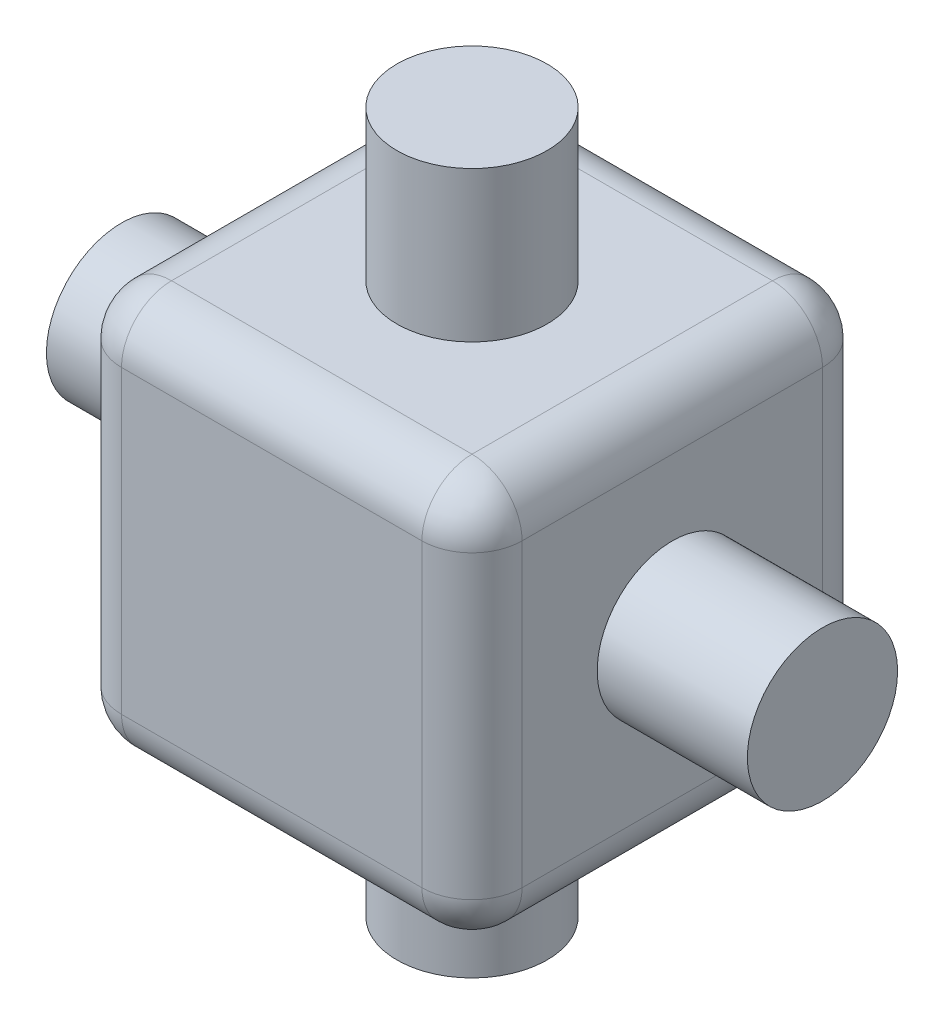
ISO-10303-21;
HEADER;
FILE_DESCRIPTION(('STEP AP214'),'2;1');
FILE_NAME('part.step','',(''),(''),'','','');
FILE_SCHEMA(('AUTOMOTIVE_DESIGN { 1 0 10303 214 1 1 1 1 }'));
ENDSEC;
DATA;
#1=APPLICATION_CONTEXT('core data for automotive mechanical design processes');
#2=APPLICATION_PROTOCOL_DEFINITION('international standard','automotive_design',2000,#1);
#3=PRODUCT_CONTEXT('',#1,'mechanical');
#4=PRODUCT('Part','Part','',(#3));
#5=PRODUCT_RELATED_PRODUCT_CATEGORY('part','',(#4));
#6=PRODUCT_DEFINITION_FORMATION('','',#4);
#7=PRODUCT_DEFINITION_CONTEXT('part definition',#1,'design');
#8=PRODUCT_DEFINITION('design','',#6,#7);
#9=PRODUCT_DEFINITION_SHAPE('','',#8);
#10=(LENGTH_UNIT() NAMED_UNIT(*) SI_UNIT(.MILLI.,.METRE.));
#11=(NAMED_UNIT(*) PLANE_ANGLE_UNIT() SI_UNIT($,.RADIAN.));
#12=(NAMED_UNIT(*) SI_UNIT($,.STERADIAN.) SOLID_ANGLE_UNIT());
#13=UNCERTAINTY_MEASURE_WITH_UNIT(LENGTH_MEASURE(1.E-05),#10,'distance_accuracy_value','');
#14=(GEOMETRIC_REPRESENTATION_CONTEXT(3) GLOBAL_UNCERTAINTY_ASSIGNED_CONTEXT((#13)) GLOBAL_UNIT_ASSIGNED_CONTEXT((#10,
#11,#12)) REPRESENTATION_CONTEXT('',''));
#15=CARTESIAN_POINT('',(0.,0.,0.));
#16=DIRECTION('',(0.,0.,1.));
#17=DIRECTION('',(1.,0.,0.));
#18=AXIS2_PLACEMENT_3D('',#15,#16,#17);
#19=CARTESIAN_POINT('',(0.,3.,1.));
#20=DIRECTION('',(1.,0.,0.));
#21=DIRECTION('',(0.,1.,0.));
#22=AXIS2_PLACEMENT_3D('',#19,#20,#21);
#23=CYLINDRICAL_SURFACE('',#22,1.);
#24=CARTESIAN_POINT('',(3.,3.,1.));
#25=DIRECTION('',(1.,0.,0.));
#26=DIRECTION('',(0.,0.,-1.));
#27=AXIS2_PLACEMENT_3D('',#24,#25,#26);
#28=CIRCLE('',#27,1.);
#29=CARTESIAN_POINT('',(3.,3.,0.));
#30=VERTEX_POINT('',#29);
#31=CARTESIAN_POINT('',(3.,4.,1.));
#32=VERTEX_POINT('',#31);
#33=EDGE_CURVE('E11',#30,#32,#28,.T.);
#34=ORIENTED_EDGE('',*,*,#33,.F.);
#35=DIRECTION('',(1.,0.,0.));
#36=VECTOR('',#35,1.);
#37=CARTESIAN_POINT('',(0.,3.,0.));
#38=LINE('',#37,#36);
#39=CARTESIAN_POINT('',(-3.,3.,0.));
#40=VERTEX_POINT('',#39);
#41=EDGE_CURVE('E307',#40,#30,#38,.T.);
#42=ORIENTED_EDGE('',*,*,#41,.F.);
#43=CARTESIAN_POINT('',(-3.,3.,1.));
#44=DIRECTION('',(1.,0.,0.));
#45=DIRECTION('',(0.,0.,-1.));
#46=AXIS2_PLACEMENT_3D('',#43,#44,#45);
#47=CIRCLE('',#46,1.);
#48=CARTESIAN_POINT('',(-3.,4.,1.));
#49=VERTEX_POINT('',#48);
#50=EDGE_CURVE('E55',#40,#49,#47,.T.);
#51=ORIENTED_EDGE('',*,*,#50,.T.);
#52=DIRECTION('',(1.,0.,0.));
#53=VECTOR('',#52,1.);
#54=CARTESIAN_POINT('',(4.,4.,1.));
#55=LINE('',#54,#53);
#56=EDGE_CURVE('E271',#32,#49,#55,.F.);
#57=ORIENTED_EDGE('',*,*,#56,.F.);
#58=EDGE_LOOP('',(#34,#42,#51,#57));
#59=FACE_BOUND('',#58,.T.);
#60=ADVANCED_FACE('F47',(#59),#23,.T.);
#61=CARTESIAN_POINT('',(-3.,3.,1.));
#62=DIRECTION('',(0.,-1.,0.));
#63=DIRECTION('',(1.,0.,0.));
#64=AXIS2_PLACEMENT_3D('',#61,#62,#63);
#65=SPHERICAL_SURFACE('',#64,1.);
#66=ORIENTED_EDGE('',*,*,#50,.F.);
#67=CARTESIAN_POINT('',(-3.,3.,1.));
#68=DIRECTION('',(0.,1.,0.));
#69=DIRECTION('',(0.,0.,1.));
#70=AXIS2_PLACEMENT_3D('',#67,#68,#69);
#71=CIRCLE('',#70,1.);
#72=CARTESIAN_POINT('',(-4.,3.,1.));
#73=VERTEX_POINT('',#72);
#74=EDGE_CURVE('E303',#73,#40,#71,.F.);
#75=ORIENTED_EDGE('',*,*,#74,.F.);
#76=CARTESIAN_POINT('',(-3.,3.,1.));
#77=DIRECTION('',(0.,0.,-1.));
#78=DIRECTION('',(-1.,0.,0.));
#79=AXIS2_PLACEMENT_3D('',#76,#77,#78);
#80=CIRCLE('',#79,1.);
#81=EDGE_CURVE('E68',#73,#49,#80,.T.);
#82=ORIENTED_EDGE('',*,*,#81,.T.);
#83=EDGE_LOOP('',(#66,#75,#82));
#84=FACE_BOUND('',#83,.T.);
#85=ADVANCED_FACE('F333',(#84),#65,.T.);
#86=CARTESIAN_POINT('',(-3.,3.,8.));
#87=DIRECTION('',(0.,0.,-1.));
#88=DIRECTION('',(-1.,0.,0.));
#89=AXIS2_PLACEMENT_3D('',#86,#87,#88);
#90=CYLINDRICAL_SURFACE('',#89,1.);
#91=ORIENTED_EDGE('',*,*,#81,.F.);
#92=DIRECTION('',(0.,0.,-1.));
#93=VECTOR('',#92,1.);
#94=CARTESIAN_POINT('',(-4.,3.,8.));
#95=LINE('',#94,#93);
#96=CARTESIAN_POINT('',(-4.,3.,7.));
#97=VERTEX_POINT('',#96);
#98=EDGE_CURVE('E299',#97,#73,#95,.T.);
#99=ORIENTED_EDGE('',*,*,#98,.F.);
#100=CARTESIAN_POINT('',(-3.,3.,7.));
#101=DIRECTION('',(0.,0.,-1.));
#102=DIRECTION('',(-1.,0.,0.));
#103=AXIS2_PLACEMENT_3D('',#100,#101,#102);
#104=CIRCLE('',#103,1.);
#105=CARTESIAN_POINT('',(-3.,4.,7.));
#106=VERTEX_POINT('',#105);
#107=EDGE_CURVE('E326',#97,#106,#104,.T.);
#108=ORIENTED_EDGE('',*,*,#107,.T.);
#109=DIRECTION('',(0.,0.,-1.));
#110=VECTOR('',#109,1.);
#111=CARTESIAN_POINT('',(-3.,4.,8.));
#112=LINE('',#111,#110);
#113=EDGE_CURVE('E275',#49,#106,#112,.F.);
#114=ORIENTED_EDGE('',*,*,#113,.F.);
#115=EDGE_LOOP('',(#91,#99,#108,#114));
#116=FACE_BOUND('',#115,.T.);
#117=ADVANCED_FACE('F334',(#116),#90,.T.);
#118=CARTESIAN_POINT('',(-3.,3.,7.));
#119=DIRECTION('',(0.,-1.,0.));
#120=DIRECTION('',(1.,0.,0.));
#121=AXIS2_PLACEMENT_3D('',#118,#119,#120);
#122=SPHERICAL_SURFACE('',#121,1.);
#123=ORIENTED_EDGE('',*,*,#107,.F.);
#124=CARTESIAN_POINT('',(-3.,3.,7.));
#125=DIRECTION('',(0.,-1.,0.));
#126=DIRECTION('',(0.,0.,-1.));
#127=AXIS2_PLACEMENT_3D('',#124,#125,#126);
#128=CIRCLE('',#127,1.);
#129=CARTESIAN_POINT('',(-3.,3.,8.));
#130=VERTEX_POINT('',#129);
#131=EDGE_CURVE('E295',#130,#97,#128,.T.);
#132=ORIENTED_EDGE('',*,*,#131,.F.);
#133=CARTESIAN_POINT('',(-3.,3.,7.));
#134=DIRECTION('',(-1.,0.,0.));
#135=DIRECTION('',(0.,0.,1.));
#136=AXIS2_PLACEMENT_3D('',#133,#134,#135);
#137=CIRCLE('',#136,1.);
#138=EDGE_CURVE('E322',#130,#106,#137,.T.);
#139=ORIENTED_EDGE('',*,*,#138,.T.);
#140=EDGE_LOOP('',(#123,#132,#139));
#141=FACE_BOUND('',#140,.T.);
#142=ADVANCED_FACE('F387',(#141),#122,.T.);
#143=CARTESIAN_POINT('',(0.,3.,7.));
#144=DIRECTION('',(1.,0.,0.));
#145=DIRECTION('',(0.,1.,0.));
#146=AXIS2_PLACEMENT_3D('',#143,#144,#145);
#147=CYLINDRICAL_SURFACE('',#146,1.);
#148=ORIENTED_EDGE('',*,*,#138,.F.);
#149=DIRECTION('',(-1.,0.,0.));
#150=VECTOR('',#149,1.);
#151=CARTESIAN_POINT('',(0.,3.,8.));
#152=LINE('',#151,#150);
#153=CARTESIAN_POINT('',(3.,3.,8.));
#154=VERTEX_POINT('',#153);
#155=EDGE_CURVE('E291',#154,#130,#152,.T.);
#156=ORIENTED_EDGE('',*,*,#155,.F.);
#157=CARTESIAN_POINT('',(3.,3.,7.));
#158=DIRECTION('',(-1.,0.,0.));
#159=DIRECTION('',(0.,0.,1.));
#160=AXIS2_PLACEMENT_3D('',#157,#158,#159);
#161=CIRCLE('',#160,1.);
#162=CARTESIAN_POINT('',(3.,4.,7.));
#163=VERTEX_POINT('',#162);
#164=EDGE_CURVE('E319',#154,#163,#161,.T.);
#165=ORIENTED_EDGE('',*,*,#164,.T.);
#166=DIRECTION('',(-1.,0.,0.));
#167=VECTOR('',#166,1.);
#168=CARTESIAN_POINT('',(0.,4.,7.));
#169=LINE('',#168,#167);
#170=EDGE_CURVE('E279',#106,#163,#169,.F.);
#171=ORIENTED_EDGE('',*,*,#170,.F.);
#172=EDGE_LOOP('',(#148,#156,#165,#171));
#173=FACE_BOUND('',#172,.T.);
#174=ADVANCED_FACE('F392',(#173),#147,.T.);
#175=CARTESIAN_POINT('',(3.,3.,7.));
#176=DIRECTION('',(0.,-1.,0.));
#177=DIRECTION('',(1.,0.,0.));
#178=AXIS2_PLACEMENT_3D('',#175,#176,#177);
#179=SPHERICAL_SURFACE('',#178,1.);
#180=ORIENTED_EDGE('',*,*,#164,.F.);
#181=CARTESIAN_POINT('',(3.,3.,7.));
#182=DIRECTION('',(0.,-1.,0.));
#183=DIRECTION('',(0.,0.,-1.));
#184=AXIS2_PLACEMENT_3D('',#181,#182,#183);
#185=CIRCLE('',#184,1.);
#186=CARTESIAN_POINT('',(4.,3.,7.));
#187=VERTEX_POINT('',#186);
#188=EDGE_CURVE('E287',#187,#154,#185,.T.);
#189=ORIENTED_EDGE('',*,*,#188,.F.);
#190=CARTESIAN_POINT('',(3.,3.,7.));
#191=DIRECTION('',(0.,0.,1.));
#192=DIRECTION('',(1.,0.,0.));
#193=AXIS2_PLACEMENT_3D('',#190,#191,#192);
#194=CIRCLE('',#193,1.);
#195=EDGE_CURVE('E315',#187,#163,#194,.T.);
#196=ORIENTED_EDGE('',*,*,#195,.T.);
#197=EDGE_LOOP('',(#180,#189,#196));
#198=FACE_BOUND('',#197,.T.);
#199=ADVANCED_FACE('F396',(#198),#179,.T.);
#200=CARTESIAN_POINT('',(3.,3.,8.));
#201=DIRECTION('',(0.,0.,1.));
#202=DIRECTION('',(1.,0.,0.));
#203=AXIS2_PLACEMENT_3D('',#200,#201,#202);
#204=CYLINDRICAL_SURFACE('',#203,1.);
#205=ORIENTED_EDGE('',*,*,#195,.F.);
#206=DIRECTION('',(0.,0.,1.));
#207=VECTOR('',#206,1.);
#208=CARTESIAN_POINT('',(4.,3.,8.));
#209=LINE('',#208,#207);
#210=CARTESIAN_POINT('',(4.,3.,1.));
#211=VERTEX_POINT('',#210);
#212=EDGE_CURVE('E268',#211,#187,#209,.T.);
#213=ORIENTED_EDGE('',*,*,#212,.F.);
#214=CARTESIAN_POINT('',(3.,3.,1.));
#215=DIRECTION('',(0.,0.,1.));
#216=DIRECTION('',(1.,0.,0.));
#217=AXIS2_PLACEMENT_3D('',#214,#215,#216);
#218=CIRCLE('',#217,1.);
#219=EDGE_CURVE('E311',#211,#32,#218,.T.);
#220=ORIENTED_EDGE('',*,*,#219,.T.);
#221=DIRECTION('',(0.,0.,1.));
#222=VECTOR('',#221,1.);
#223=CARTESIAN_POINT('',(3.,4.,8.));
#224=LINE('',#223,#222);
#225=EDGE_CURVE('E283',#163,#32,#224,.F.);
#226=ORIENTED_EDGE('',*,*,#225,.F.);
#227=EDGE_LOOP('',(#205,#213,#220,#226));
#228=FACE_BOUND('',#227,.T.);
#229=ADVANCED_FACE('F341',(#228),#204,.T.);
#230=CARTESIAN_POINT('',(3.,3.,1.));
#231=DIRECTION('',(0.,-1.,0.));
#232=DIRECTION('',(1.,0.,0.));
#233=AXIS2_PLACEMENT_3D('',#230,#231,#232);
#234=SPHERICAL_SURFACE('',#233,1.);
#235=CARTESIAN_POINT('',(3.,3.,1.));
#236=DIRECTION('',(0.,1.,0.));
#237=DIRECTION('',(0.,0.,1.));
#238=AXIS2_PLACEMENT_3D('',#235,#236,#237);
#239=CIRCLE('',#238,1.);
#240=EDGE_CURVE('E176',#30,#211,#239,.F.);
#241=ORIENTED_EDGE('',*,*,#240,.F.);
#242=ORIENTED_EDGE('',*,*,#33,.T.);
#243=ORIENTED_EDGE('',*,*,#219,.F.);
#244=EDGE_LOOP('',(#241,#242,#243));
#245=FACE_BOUND('',#244,.T.);
#246=ADVANCED_FACE('F345',(#245),#234,.T.);
#247=CARTESIAN_POINT('',(4.,-3.,1.));
#248=DIRECTION('',(1.,0.,0.));
#249=DIRECTION('',(0.,0.,-1.));
#250=AXIS2_PLACEMENT_3D('',#247,#248,#249);
#251=CYLINDRICAL_SURFACE('',#250,1.);
#252=CARTESIAN_POINT('',(3.,-3.,1.));
#253=DIRECTION('',(1.,0.,0.));
#254=DIRECTION('',(0.,0.,-1.));
#255=AXIS2_PLACEMENT_3D('',#252,#253,#254);
#256=CIRCLE('',#255,1.);
#257=CARTESIAN_POINT('',(3.,-4.,1.));
#258=VERTEX_POINT('',#257);
#259=CARTESIAN_POINT('',(3.,-3.,0.));
#260=VERTEX_POINT('',#259);
#261=EDGE_CURVE('E166',#258,#260,#256,.T.);
#262=ORIENTED_EDGE('',*,*,#261,.F.);
#263=DIRECTION('',(1.,0.,0.));
#264=VECTOR('',#263,1.);
#265=CARTESIAN_POINT('',(4.,-4.,1.));
#266=LINE('',#265,#264);
#267=CARTESIAN_POINT('',(-3.,-4.,1.));
#268=VERTEX_POINT('',#267);
#269=EDGE_CURVE('E171',#268,#258,#266,.T.);
#270=ORIENTED_EDGE('',*,*,#269,.F.);
#271=CARTESIAN_POINT('',(-3.,-3.,1.));
#272=DIRECTION('',(1.,0.,0.));
#273=DIRECTION('',(0.,0.,-1.));
#274=AXIS2_PLACEMENT_3D('',#271,#272,#273);
#275=CIRCLE('',#274,1.);
#276=CARTESIAN_POINT('',(-3.,-3.,0.));
#277=VERTEX_POINT('',#276);
#278=EDGE_CURVE('E261',#268,#277,#275,.T.);
#279=ORIENTED_EDGE('',*,*,#278,.T.);
#280=DIRECTION('',(1.,0.,0.));
#281=VECTOR('',#280,1.);
#282=CARTESIAN_POINT('',(0.,-3.,0.));
#283=LINE('',#282,#281);
#284=EDGE_CURVE('E149',#260,#277,#283,.F.);
#285=ORIENTED_EDGE('',*,*,#284,.F.);
#286=EDGE_LOOP('',(#262,#270,#279,#285));
#287=FACE_BOUND('',#286,.T.);
#288=ADVANCED_FACE('F369',(#287),#251,.T.);
#289=CARTESIAN_POINT('',(-3.,-3.,1.));
#290=DIRECTION('',(0.,1.,0.));
#291=DIRECTION('',(0.,0.,1.));
#292=AXIS2_PLACEMENT_3D('',#289,#290,#291);
#293=SPHERICAL_SURFACE('',#292,1.);
#294=ORIENTED_EDGE('',*,*,#278,.F.);
#295=CARTESIAN_POINT('',(-3.,-3.,1.));
#296=DIRECTION('',(0.,0.,-1.));
#297=DIRECTION('',(-1.,0.,0.));
#298=AXIS2_PLACEMENT_3D('',#295,#296,#297);
#299=CIRCLE('',#298,1.);
#300=CARTESIAN_POINT('',(-4.,-3.,1.));
#301=VERTEX_POINT('',#300);
#302=EDGE_CURVE('E257',#268,#301,#299,.T.);
#303=ORIENTED_EDGE('',*,*,#302,.T.);
#304=CARTESIAN_POINT('',(-3.,-3.,1.));
#305=DIRECTION('',(0.,1.,0.));
#306=DIRECTION('',(0.,0.,1.));
#307=AXIS2_PLACEMENT_3D('',#304,#305,#306);
#308=CIRCLE('',#307,1.);
#309=EDGE_CURVE('E238',#277,#301,#308,.T.);
#310=ORIENTED_EDGE('',*,*,#309,.F.);
#311=EDGE_LOOP('',(#294,#303,#310));
#312=FACE_BOUND('',#311,.T.);
#313=ADVANCED_FACE('F359',(#312),#293,.T.);
#314=CARTESIAN_POINT('',(-3.,-3.,8.));
#315=DIRECTION('',(0.,0.,-1.));
#316=DIRECTION('',(-1.,0.,0.));
#317=AXIS2_PLACEMENT_3D('',#314,#315,#316);
#318=CYLINDRICAL_SURFACE('',#317,1.);
#319=ORIENTED_EDGE('',*,*,#302,.F.);
#320=DIRECTION('',(0.,0.,-1.));
#321=VECTOR('',#320,1.);
#322=CARTESIAN_POINT('',(-3.,-4.,8.));
#323=LINE('',#322,#321);
#324=CARTESIAN_POINT('',(-3.,-4.,7.));
#325=VERTEX_POINT('',#324);
#326=EDGE_CURVE('E213',#325,#268,#323,.T.);
#327=ORIENTED_EDGE('',*,*,#326,.F.);
#328=CARTESIAN_POINT('',(-3.,-3.,7.));
#329=DIRECTION('',(0.,0.,-1.));
#330=DIRECTION('',(-1.,0.,0.));
#331=AXIS2_PLACEMENT_3D('',#328,#329,#330);
#332=CIRCLE('',#331,1.);
#333=CARTESIAN_POINT('',(-4.,-3.,7.));
#334=VERTEX_POINT('',#333);
#335=EDGE_CURVE('E254',#325,#334,#332,.T.);
#336=ORIENTED_EDGE('',*,*,#335,.T.);
#337=DIRECTION('',(0.,0.,-1.));
#338=VECTOR('',#337,1.);
#339=CARTESIAN_POINT('',(-4.,-3.,8.));
#340=LINE('',#339,#338);
#341=EDGE_CURVE('E234',#301,#334,#340,.F.);
#342=ORIENTED_EDGE('',*,*,#341,.F.);
#343=EDGE_LOOP('',(#319,#327,#336,#342));
#344=FACE_BOUND('',#343,.T.);
#345=ADVANCED_FACE('F362',(#344),#318,.T.);
#346=CARTESIAN_POINT('',(-3.,-3.,7.));
#347=DIRECTION('',(0.,1.,0.));
#348=DIRECTION('',(0.,0.,1.));
#349=AXIS2_PLACEMENT_3D('',#346,#347,#348);
#350=SPHERICAL_SURFACE('',#349,1.);
#351=ORIENTED_EDGE('',*,*,#335,.F.);
#352=CARTESIAN_POINT('',(-3.,-3.,7.));
#353=DIRECTION('',(-1.,0.,0.));
#354=DIRECTION('',(0.,0.,1.));
#355=AXIS2_PLACEMENT_3D('',#352,#353,#354);
#356=CIRCLE('',#355,1.);
#357=CARTESIAN_POINT('',(-3.,-3.,8.));
#358=VERTEX_POINT('',#357);
#359=EDGE_CURVE('E250',#325,#358,#356,.T.);
#360=ORIENTED_EDGE('',*,*,#359,.T.);
#361=CARTESIAN_POINT('',(-3.,-3.,7.));
#362=DIRECTION('',(0.,-1.,0.));
#363=DIRECTION('',(0.,0.,-1.));
#364=AXIS2_PLACEMENT_3D('',#361,#362,#363);
#365=CIRCLE('',#364,1.);
#366=EDGE_CURVE('E230',#334,#358,#365,.F.);
#367=ORIENTED_EDGE('',*,*,#366,.F.);
#368=EDGE_LOOP('',(#351,#360,#367));
#369=FACE_BOUND('',#368,.T.);
#370=ADVANCED_FACE('F584',(#369),#350,.T.);
#371=CARTESIAN_POINT('',(4.,-3.,7.));
#372=DIRECTION('',(1.,0.,0.));
#373=DIRECTION('',(0.,0.,-1.));
#374=AXIS2_PLACEMENT_3D('',#371,#372,#373);
#375=CYLINDRICAL_SURFACE('',#374,1.);
#376=ORIENTED_EDGE('',*,*,#359,.F.);
#377=DIRECTION('',(-1.,0.,0.));
#378=VECTOR('',#377,1.);
#379=CARTESIAN_POINT('',(4.,-4.,7.));
#380=LINE('',#379,#378);
#381=CARTESIAN_POINT('',(3.,-4.,7.));
#382=VERTEX_POINT('',#381);
#383=EDGE_CURVE('E217',#382,#325,#380,.T.);
#384=ORIENTED_EDGE('',*,*,#383,.F.);
#385=CARTESIAN_POINT('',(3.,-3.,7.));
#386=DIRECTION('',(-1.,0.,0.));
#387=DIRECTION('',(0.,0.,1.));
#388=AXIS2_PLACEMENT_3D('',#385,#386,#387);
#389=CIRCLE('',#388,1.);
#390=CARTESIAN_POINT('',(3.,-3.,8.));
#391=VERTEX_POINT('',#390);
#392=EDGE_CURVE('E247',#382,#391,#389,.T.);
#393=ORIENTED_EDGE('',*,*,#392,.T.);
#394=DIRECTION('',(-1.,0.,0.));
#395=VECTOR('',#394,1.);
#396=CARTESIAN_POINT('',(4.,-3.,8.));
#397=LINE('',#396,#395);
#398=EDGE_CURVE('E226',#358,#391,#397,.F.);
#399=ORIENTED_EDGE('',*,*,#398,.F.);
#400=EDGE_LOOP('',(#376,#384,#393,#399));
#401=FACE_BOUND('',#400,.T.);
#402=ADVANCED_FACE('F592',(#401),#375,.T.);
#403=CARTESIAN_POINT('',(3.,-3.,7.));
#404=DIRECTION('',(0.,1.,0.));
#405=DIRECTION('',(0.,0.,1.));
#406=AXIS2_PLACEMENT_3D('',#403,#404,#405);
#407=SPHERICAL_SURFACE('',#406,1.);
#408=ORIENTED_EDGE('',*,*,#392,.F.);
#409=CARTESIAN_POINT('',(3.,-3.,7.));
#410=DIRECTION('',(0.,0.,1.));
#411=DIRECTION('',(1.,0.,0.));
#412=AXIS2_PLACEMENT_3D('',#409,#410,#411);
#413=CIRCLE('',#412,1.);
#414=CARTESIAN_POINT('',(4.,-3.,7.));
#415=VERTEX_POINT('',#414);
#416=EDGE_CURVE('E148',#382,#415,#413,.T.);
#417=ORIENTED_EDGE('',*,*,#416,.T.);
#418=CARTESIAN_POINT('',(3.,-3.,7.));
#419=DIRECTION('',(0.,-1.,0.));
#420=DIRECTION('',(0.,0.,-1.));
#421=AXIS2_PLACEMENT_3D('',#418,#419,#420);
#422=CIRCLE('',#421,1.);
#423=EDGE_CURVE('E161',#391,#415,#422,.F.);
#424=ORIENTED_EDGE('',*,*,#423,.F.);
#425=EDGE_LOOP('',(#408,#417,#424));
#426=FACE_BOUND('',#425,.T.);
#427=ADVANCED_FACE('F601',(#426),#407,.T.);
#428=CARTESIAN_POINT('',(3.,-3.,8.));
#429=DIRECTION('',(0.,0.,1.));
#430=DIRECTION('',(1.,0.,0.));
#431=AXIS2_PLACEMENT_3D('',#428,#429,#430);
#432=CYLINDRICAL_SURFACE('',#431,1.);
#433=ORIENTED_EDGE('',*,*,#416,.F.);
#434=DIRECTION('',(0.,0.,1.));
#435=VECTOR('',#434,1.);
#436=CARTESIAN_POINT('',(3.,-4.,8.));
#437=LINE('',#436,#435);
#438=EDGE_CURVE('E142',#258,#382,#437,.T.);
#439=ORIENTED_EDGE('',*,*,#438,.F.);
#440=CARTESIAN_POINT('',(3.,-3.,1.));
#441=DIRECTION('',(0.,0.,1.));
#442=DIRECTION('',(1.,0.,0.));
#443=AXIS2_PLACEMENT_3D('',#440,#441,#442);
#444=CIRCLE('',#443,1.);
#445=CARTESIAN_POINT('',(4.,-3.,1.));
#446=VERTEX_POINT('',#445);
#447=EDGE_CURVE('E136',#258,#446,#444,.T.);
#448=ORIENTED_EDGE('',*,*,#447,.T.);
#449=DIRECTION('',(0.,0.,1.));
#450=VECTOR('',#449,1.);
#451=CARTESIAN_POINT('',(4.,-3.,8.));
#452=LINE('',#451,#450);
#453=EDGE_CURVE('E140',#415,#446,#452,.F.);
#454=ORIENTED_EDGE('',*,*,#453,.F.);
#455=EDGE_LOOP('',(#433,#439,#448,#454));
#456=FACE_BOUND('',#455,.T.);
#457=ADVANCED_FACE('F139',(#456),#432,.T.);
#458=CARTESIAN_POINT('',(3.,-3.,1.));
#459=DIRECTION('',(0.,1.,0.));
#460=DIRECTION('',(0.,0.,1.));
#461=AXIS2_PLACEMENT_3D('',#458,#459,#460);
#462=SPHERICAL_SURFACE('',#461,1.);
#463=ORIENTED_EDGE('',*,*,#447,.F.);
#464=ORIENTED_EDGE('',*,*,#261,.T.);
#465=CARTESIAN_POINT('',(3.,-3.,1.));
#466=DIRECTION('',(0.,1.,0.));
#467=DIRECTION('',(0.,0.,1.));
#468=AXIS2_PLACEMENT_3D('',#465,#466,#467);
#469=CIRCLE('',#468,1.);
#470=EDGE_CURVE('E164',#446,#260,#469,.T.);
#471=ORIENTED_EDGE('',*,*,#470,.F.);
#472=EDGE_LOOP('',(#463,#464,#471));
#473=FACE_BOUND('',#472,.T.);
#474=ADVANCED_FACE('F165',(#473),#462,.T.);
#475=CARTESIAN_POINT('',(3.,0.,7.));
#476=DIRECTION('',(0.,-1.,0.));
#477=DIRECTION('',(0.,0.,-1.));
#478=AXIS2_PLACEMENT_3D('',#475,#476,#477);
#479=CYLINDRICAL_SURFACE('',#478,1.);
#480=DIRECTION('',(0.,1.,0.));
#481=VECTOR('',#480,1.);
#482=CARTESIAN_POINT('',(4.,0.,7.));
#483=LINE('',#482,#481);
#484=EDGE_CURVE('E158',#187,#415,#483,.F.);
#485=ORIENTED_EDGE('',*,*,#484,.F.);
#486=ORIENTED_EDGE('',*,*,#188,.T.);
#487=DIRECTION('',(0.,1.,0.));
#488=VECTOR('',#487,1.);
#489=CARTESIAN_POINT('',(3.,0.,8.));
#490=LINE('',#489,#488);
#491=EDGE_CURVE('E205',#391,#154,#490,.T.);
#492=ORIENTED_EDGE('',*,*,#491,.F.);
#493=ORIENTED_EDGE('',*,*,#423,.T.);
#494=EDGE_LOOP('',(#485,#486,#492,#493));
#495=FACE_BOUND('',#494,.T.);
#496=ADVANCED_FACE('F415',(#495),#479,.T.);
#497=CARTESIAN_POINT('',(-3.,-4.,7.));
#498=DIRECTION('',(0.,-1.,0.));
#499=DIRECTION('',(0.,0.,-1.));
#500=AXIS2_PLACEMENT_3D('',#497,#498,#499);
#501=CYLINDRICAL_SURFACE('',#500,1.);
#502=DIRECTION('',(0.,1.,0.));
#503=VECTOR('',#502,1.);
#504=CARTESIAN_POINT('',(-3.,-4.,8.));
#505=LINE('',#504,#503);
#506=EDGE_CURVE('E202',#130,#358,#505,.F.);
#507=ORIENTED_EDGE('',*,*,#506,.F.);
#508=ORIENTED_EDGE('',*,*,#131,.T.);
#509=DIRECTION('',(0.,1.,0.));
#510=VECTOR('',#509,1.);
#511=CARTESIAN_POINT('',(-4.,-4.,7.));
#512=LINE('',#511,#510);
#513=EDGE_CURVE('E198',#334,#97,#512,.T.);
#514=ORIENTED_EDGE('',*,*,#513,.F.);
#515=ORIENTED_EDGE('',*,*,#366,.T.);
#516=EDGE_LOOP('',(#507,#508,#514,#515));
#517=FACE_BOUND('',#516,.T.);
#518=ADVANCED_FACE('F419',(#517),#501,.T.);
#519=CARTESIAN_POINT('',(-3.,0.,1.));
#520=DIRECTION('',(0.,1.,0.));
#521=DIRECTION('',(0.,0.,1.));
#522=AXIS2_PLACEMENT_3D('',#519,#520,#521);
#523=CYLINDRICAL_SURFACE('',#522,1.);
#524=DIRECTION('',(0.,1.,0.));
#525=VECTOR('',#524,1.);
#526=CARTESIAN_POINT('',(-4.,-4.,1.));
#527=LINE('',#526,#525);
#528=EDGE_CURVE('E195',#73,#301,#527,.F.);
#529=ORIENTED_EDGE('',*,*,#528,.F.);
#530=ORIENTED_EDGE('',*,*,#74,.T.);
#531=DIRECTION('',(0.,1.,0.));
#532=VECTOR('',#531,1.);
#533=CARTESIAN_POINT('',(-3.,0.,0.));
#534=LINE('',#533,#532);
#535=EDGE_CURVE('E183',#277,#40,#534,.T.);
#536=ORIENTED_EDGE('',*,*,#535,.F.);
#537=ORIENTED_EDGE('',*,*,#309,.T.);
#538=EDGE_LOOP('',(#529,#530,#536,#537));
#539=FACE_BOUND('',#538,.T.);
#540=ADVANCED_FACE('F352',(#539),#523,.T.);
#541=CARTESIAN_POINT('',(3.,-4.,1.));
#542=DIRECTION('',(0.,1.,0.));
#543=DIRECTION('',(0.,0.,1.));
#544=AXIS2_PLACEMENT_3D('',#541,#542,#543);
#545=CYLINDRICAL_SURFACE('',#544,1.);
#546=DIRECTION('',(0.,1.,0.));
#547=VECTOR('',#546,1.);
#548=CARTESIAN_POINT('',(3.,0.,0.));
#549=LINE('',#548,#547);
#550=EDGE_CURVE('E178',#30,#260,#549,.F.);
#551=ORIENTED_EDGE('',*,*,#550,.F.);
#552=ORIENTED_EDGE('',*,*,#240,.T.);
#553=DIRECTION('',(0.,1.,0.));
#554=VECTOR('',#553,1.);
#555=CARTESIAN_POINT('',(4.,-4.,1.));
#556=LINE('',#555,#554);
#557=EDGE_CURVE('E156',#446,#211,#556,.T.);
#558=ORIENTED_EDGE('',*,*,#557,.F.);
#559=ORIENTED_EDGE('',*,*,#470,.T.);
#560=EDGE_LOOP('',(#551,#552,#558,#559));
#561=FACE_BOUND('',#560,.T.);
#562=ADVANCED_FACE('F174',(#561),#545,.T.);
#563=CARTESIAN_POINT('',(-4.,-4.,8.));
#564=DIRECTION('',(1.,0.,0.));
#565=DIRECTION('',(0.,0.,-1.));
#566=AXIS2_PLACEMENT_3D('',#563,#564,#565);
#567=PLANE('',#566);
#568=CARTESIAN_POINT('',(-4.,0.,4.));
#569=DIRECTION('',(-1.,0.,0.));
#570=DIRECTION('',(0.,0.,1.));
#571=AXIS2_PLACEMENT_3D('',#568,#569,#570);
#572=CIRCLE('',#571,1.5);
#573=CARTESIAN_POINT('',(-4.,0.,5.5));
#574=VERTEX_POINT('',#573);
#575=EDGE_CURVE('E179',#574,#574,#572,.T.);
#576=ORIENTED_EDGE('',*,*,#575,.F.);
#577=EDGE_LOOP('',(#576));
#578=FACE_BOUND('',#577,.T.);
#579=ORIENTED_EDGE('',*,*,#513,.T.);
#580=ORIENTED_EDGE('',*,*,#98,.T.);
#581=ORIENTED_EDGE('',*,*,#528,.T.);
#582=ORIENTED_EDGE('',*,*,#341,.T.);
#583=EDGE_LOOP('',(#579,#580,#581,#582));
#584=FACE_BOUND('',#583,.T.);
#585=ADVANCED_FACE('F355',(#578,#584),#567,.F.);
#586=CARTESIAN_POINT('',(4.,-4.,8.));
#587=DIRECTION('',(0.,1.,0.));
#588=DIRECTION('',(0.,0.,1.));
#589=AXIS2_PLACEMENT_3D('',#586,#587,#588);
#590=PLANE('',#589);
#591=ORIENTED_EDGE('',*,*,#269,.T.);
#592=ORIENTED_EDGE('',*,*,#438,.T.);
#593=ORIENTED_EDGE('',*,*,#383,.T.);
#594=ORIENTED_EDGE('',*,*,#326,.T.);
#595=EDGE_LOOP('',(#591,#592,#593,#594));
#596=FACE_BOUND('',#595,.T.);
#597=CARTESIAN_POINT('',(0.,-4.,4.));
#598=DIRECTION('',(0.,-1.,0.));
#599=DIRECTION('',(0.,0.,-1.));
#600=AXIS2_PLACEMENT_3D('',#597,#598,#599);
#601=CIRCLE('',#600,1.5);
#602=CARTESIAN_POINT('',(0.,-4.,2.5));
#603=VERTEX_POINT('',#602);
#604=EDGE_CURVE('E186',#603,#603,#601,.T.);
#605=ORIENTED_EDGE('',*,*,#604,.F.);
#606=EDGE_LOOP('',(#605));
#607=FACE_BOUND('',#606,.T.);
#608=ADVANCED_FACE('F365',(#596,#607),#590,.F.);
#609=CARTESIAN_POINT('',(4.,-4.,8.));
#610=DIRECTION('',(-1.,0.,0.));
#611=DIRECTION('',(0.,0.,1.));
#612=AXIS2_PLACEMENT_3D('',#609,#610,#611);
#613=PLANE('',#612);
#614=CARTESIAN_POINT('',(4.,0.,4.));
#615=DIRECTION('',(1.,0.,0.));
#616=DIRECTION('',(0.,0.,-1.));
#617=AXIS2_PLACEMENT_3D('',#614,#615,#616);
#618=CIRCLE('',#617,1.5);
#619=CARTESIAN_POINT('',(4.,0.,2.5));
#620=VERTEX_POINT('',#619);
#621=EDGE_CURVE('E698',#620,#620,#618,.T.);
#622=ORIENTED_EDGE('',*,*,#621,.F.);
#623=EDGE_LOOP('',(#622));
#624=FACE_BOUND('',#623,.T.);
#625=ORIENTED_EDGE('',*,*,#557,.T.);
#626=ORIENTED_EDGE('',*,*,#212,.T.);
#627=ORIENTED_EDGE('',*,*,#484,.T.);
#628=ORIENTED_EDGE('',*,*,#453,.T.);
#629=EDGE_LOOP('',(#625,#626,#627,#628));
#630=FACE_BOUND('',#629,.T.);
#631=ADVANCED_FACE('F153',(#624,#630),#613,.F.);
#632=CARTESIAN_POINT('',(4.,4.,8.));
#633=DIRECTION('',(0.,-1.,0.));
#634=DIRECTION('',(1.,0.,0.));
#635=AXIS2_PLACEMENT_3D('',#632,#633,#634);
#636=PLANE('',#635);
#637=ORIENTED_EDGE('',*,*,#170,.T.);
#638=ORIENTED_EDGE('',*,*,#225,.T.);
#639=ORIENTED_EDGE('',*,*,#56,.T.);
#640=ORIENTED_EDGE('',*,*,#113,.T.);
#641=EDGE_LOOP('',(#637,#638,#639,#640));
#642=FACE_BOUND('',#641,.T.);
#643=CARTESIAN_POINT('',(0.,4.,4.));
#644=DIRECTION('',(0.,1.,0.));
#645=DIRECTION('',(-1.,0.,0.));
#646=AXIS2_PLACEMENT_3D('',#643,#644,#645);
#647=CIRCLE('',#646,1.5);
#648=CARTESIAN_POINT('',(-1.5,4.,4.));
#649=VERTEX_POINT('',#648);
#650=EDGE_CURVE('E189',#649,#649,#647,.T.);
#651=ORIENTED_EDGE('',*,*,#650,.F.);
#652=EDGE_LOOP('',(#651));
#653=FACE_BOUND('',#652,.T.);
#654=ADVANCED_FACE('F336',(#642,#653),#636,.F.);
#655=CARTESIAN_POINT('',(0.,0.,8.));
#656=DIRECTION('',(0.,0.,1.));
#657=DIRECTION('',(1.,0.,0.));
#658=AXIS2_PLACEMENT_3D('',#655,#656,#657);
#659=PLANE('',#658);
#660=ORIENTED_EDGE('',*,*,#491,.T.);
#661=ORIENTED_EDGE('',*,*,#155,.T.);
#662=ORIENTED_EDGE('',*,*,#506,.T.);
#663=ORIENTED_EDGE('',*,*,#398,.T.);
#664=EDGE_LOOP('',(#660,#661,#662,#663));
#665=FACE_BOUND('',#664,.T.);
#666=ADVANCED_FACE('F468',(#665),#659,.T.);
#667=CARTESIAN_POINT('',(0.,0.,0.));
#668=DIRECTION('',(0.,0.,1.));
#669=DIRECTION('',(1.,0.,0.));
#670=AXIS2_PLACEMENT_3D('',#667,#668,#669);
#671=PLANE('',#670);
#672=ORIENTED_EDGE('',*,*,#535,.T.);
#673=ORIENTED_EDGE('',*,*,#41,.T.);
#674=ORIENTED_EDGE('',*,*,#550,.T.);
#675=ORIENTED_EDGE('',*,*,#284,.T.);
#676=EDGE_LOOP('',(#672,#673,#674,#675));
#677=FACE_BOUND('',#676,.T.);
#678=ADVANCED_FACE('F347',(#677),#671,.F.);
#679=CARTESIAN_POINT('',(0.,7.,4.));
#680=DIRECTION('',(0.,-1.,0.));
#681=DIRECTION('',(1.,0.,0.));
#682=AXIS2_PLACEMENT_3D('',#679,#680,#681);
#683=CYLINDRICAL_SURFACE('',#682,1.5);
#684=CARTESIAN_POINT('',(0.,7.,4.));
#685=DIRECTION('',(0.,1.,0.));
#686=DIRECTION('',(-1.,0.,0.));
#687=AXIS2_PLACEMENT_3D('',#684,#685,#686);
#688=CIRCLE('',#687,1.5);
#689=CARTESIAN_POINT('',(-1.5,7.,4.));
#690=VERTEX_POINT('',#689);
#691=EDGE_CURVE('E702',#690,#690,#688,.T.);
#692=ORIENTED_EDGE('',*,*,#691,.F.);
#693=EDGE_LOOP('',(#692));
#694=FACE_BOUND('',#693,.T.);
#695=ORIENTED_EDGE('',*,*,#650,.T.);
#696=EDGE_LOOP('',(#695));
#697=FACE_BOUND('',#696,.T.);
#698=ADVANCED_FACE('F483',(#694,#697),#683,.T.);
#699=CARTESIAN_POINT('',(0.,7.,4.));
#700=DIRECTION('',(0.,1.,0.));
#701=DIRECTION('',(-1.,0.,0.));
#702=AXIS2_PLACEMENT_3D('',#699,#700,#701);
#703=PLANE('',#702);
#704=ORIENTED_EDGE('',*,*,#691,.T.);
#705=EDGE_LOOP('',(#704));
#706=FACE_BOUND('',#705,.T.);
#707=ADVANCED_FACE('F495',(#706),#703,.T.);
#708=CARTESIAN_POINT('',(7.,0.,4.));
#709=DIRECTION('',(-1.,0.,0.));
#710=DIRECTION('',(0.,0.,1.));
#711=AXIS2_PLACEMENT_3D('',#708,#709,#710);
#712=CYLINDRICAL_SURFACE('',#711,1.5);
#713=CARTESIAN_POINT('',(7.,0.,4.));
#714=DIRECTION('',(1.,0.,0.));
#715=DIRECTION('',(0.,0.,-1.));
#716=AXIS2_PLACEMENT_3D('',#713,#714,#715);
#717=CIRCLE('',#716,1.5);
#718=CARTESIAN_POINT('',(7.,0.,2.5));
#719=VERTEX_POINT('',#718);
#720=EDGE_CURVE('E692',#719,#719,#717,.T.);
#721=ORIENTED_EDGE('',*,*,#720,.F.);
#722=EDGE_LOOP('',(#721));
#723=FACE_BOUND('',#722,.T.);
#724=ORIENTED_EDGE('',*,*,#621,.T.);
#725=EDGE_LOOP('',(#724));
#726=FACE_BOUND('',#725,.T.);
#727=ADVANCED_FACE('F505',(#723,#726),#712,.T.);
#728=CARTESIAN_POINT('',(7.,0.,4.));
#729=DIRECTION('',(1.,0.,0.));
#730=DIRECTION('',(0.,0.,-1.));
#731=AXIS2_PLACEMENT_3D('',#728,#729,#730);
#732=PLANE('',#731);
#733=ORIENTED_EDGE('',*,*,#720,.T.);
#734=EDGE_LOOP('',(#733));
#735=FACE_BOUND('',#734,.T.);
#736=ADVANCED_FACE('F515',(#735),#732,.T.);
#737=CARTESIAN_POINT('',(0.,-7.,4.));
#738=DIRECTION('',(0.,1.,0.));
#739=DIRECTION('',(0.,0.,1.));
#740=AXIS2_PLACEMENT_3D('',#737,#738,#739);
#741=CYLINDRICAL_SURFACE('',#740,1.5);
#742=CARTESIAN_POINT('',(0.,-7.,4.));
#743=DIRECTION('',(0.,-1.,0.));
#744=DIRECTION('',(0.,0.,-1.));
#745=AXIS2_PLACEMENT_3D('',#742,#743,#744);
#746=CIRCLE('',#745,1.5);
#747=CARTESIAN_POINT('',(0.,-7.,2.5));
#748=VERTEX_POINT('',#747);
#749=EDGE_CURVE('E688',#748,#748,#746,.T.);
#750=ORIENTED_EDGE('',*,*,#749,.F.);
#751=EDGE_LOOP('',(#750));
#752=FACE_BOUND('',#751,.T.);
#753=ORIENTED_EDGE('',*,*,#604,.T.);
#754=EDGE_LOOP('',(#753));
#755=FACE_BOUND('',#754,.T.);
#756=ADVANCED_FACE('F525',(#752,#755),#741,.T.);
#757=CARTESIAN_POINT('',(0.,-7.,4.));
#758=DIRECTION('',(0.,-1.,0.));
#759=DIRECTION('',(0.,0.,-1.));
#760=AXIS2_PLACEMENT_3D('',#757,#758,#759);
#761=PLANE('',#760);
#762=ORIENTED_EDGE('',*,*,#749,.T.);
#763=EDGE_LOOP('',(#762));
#764=FACE_BOUND('',#763,.T.);
#765=ADVANCED_FACE('F535',(#764),#761,.T.);
#766=CARTESIAN_POINT('',(-7.,0.,4.));
#767=DIRECTION('',(1.,0.,0.));
#768=DIRECTION('',(0.,0.,-1.));
#769=AXIS2_PLACEMENT_3D('',#766,#767,#768);
#770=CYLINDRICAL_SURFACE('',#769,1.5);
#771=CARTESIAN_POINT('',(-7.,0.,4.));
#772=DIRECTION('',(-1.,0.,0.));
#773=DIRECTION('',(0.,0.,1.));
#774=AXIS2_PLACEMENT_3D('',#771,#772,#773);
#775=CIRCLE('',#774,1.5);
#776=CARTESIAN_POINT('',(-7.,0.,5.5));
#777=VERTEX_POINT('',#776);
#778=EDGE_CURVE('E686',#777,#777,#775,.T.);
#779=ORIENTED_EDGE('',*,*,#778,.F.);
#780=EDGE_LOOP('',(#779));
#781=FACE_BOUND('',#780,.T.);
#782=ORIENTED_EDGE('',*,*,#575,.T.);
#783=EDGE_LOOP('',(#782));
#784=FACE_BOUND('',#783,.T.);
#785=ADVANCED_FACE('F545',(#781,#784),#770,.T.);
#786=CARTESIAN_POINT('',(-7.,0.,4.));
#787=DIRECTION('',(-1.,0.,0.));
#788=DIRECTION('',(0.,0.,1.));
#789=AXIS2_PLACEMENT_3D('',#786,#787,#788);
#790=PLANE('',#789);
#791=ORIENTED_EDGE('',*,*,#778,.T.);
#792=EDGE_LOOP('',(#791));
#793=FACE_BOUND('',#792,.T.);
#794=ADVANCED_FACE('F554',(#793),#790,.T.);
#795=CLOSED_SHELL('',(#60,#85,#117,#142,#174,#199,#229,#246,#288,#313,#345,#370,#402,#427,#457,
#474,#496,#518,#540,#562,#585,#608,#631,#654,#666,#678,#698,#707,#727,#736,#756,#765,#785,#794));
#796=MANIFOLD_SOLID_BREP('B2',#795);
#797=ADVANCED_BREP_SHAPE_REPRESENTATION('',(#18,#796),#14);
#798=SHAPE_DEFINITION_REPRESENTATION(#9,#797);
ENDSEC;
END-ISO-10303-21;
